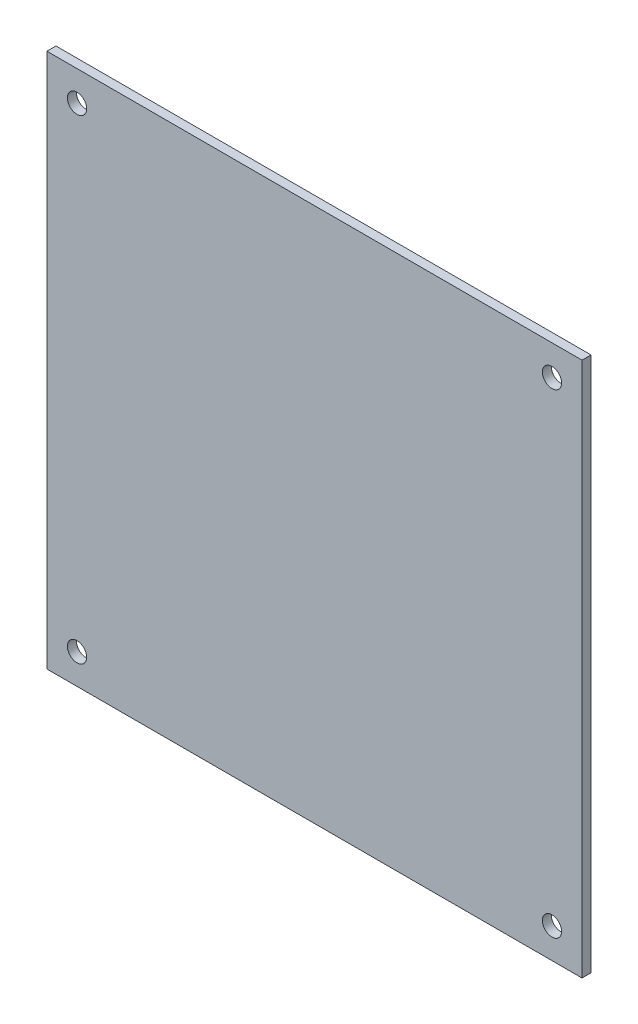
ISO-10303-21;
HEADER;
FILE_DESCRIPTION(('STEP AP214'),'2;1');
FILE_NAME('part.step','',(''),(''),'','','');
FILE_SCHEMA(('AUTOMOTIVE_DESIGN { 1 0 10303 214 1 1 1 1 }'));
ENDSEC;
DATA;
#1=APPLICATION_CONTEXT('core data for automotive mechanical design processes');
#2=APPLICATION_PROTOCOL_DEFINITION('international standard','automotive_design',2000,#1);
#3=PRODUCT_CONTEXT('',#1,'mechanical');
#4=PRODUCT('Part','Part','',(#3));
#5=PRODUCT_RELATED_PRODUCT_CATEGORY('part','',(#4));
#6=PRODUCT_DEFINITION_FORMATION('','',#4);
#7=PRODUCT_DEFINITION_CONTEXT('part definition',#1,'design');
#8=PRODUCT_DEFINITION('design','',#6,#7);
#9=PRODUCT_DEFINITION_SHAPE('','',#8);
#10=(LENGTH_UNIT() NAMED_UNIT(*) SI_UNIT(.MILLI.,.METRE.));
#11=(NAMED_UNIT(*) PLANE_ANGLE_UNIT() SI_UNIT($,.RADIAN.));
#12=(NAMED_UNIT(*) SI_UNIT($,.STERADIAN.) SOLID_ANGLE_UNIT());
#13=UNCERTAINTY_MEASURE_WITH_UNIT(LENGTH_MEASURE(1.E-05),#10,'distance_accuracy_value','');
#14=(GEOMETRIC_REPRESENTATION_CONTEXT(3) GLOBAL_UNCERTAINTY_ASSIGNED_CONTEXT((#13)) GLOBAL_UNIT_ASSIGNED_CONTEXT((#10,
#11,#12)) REPRESENTATION_CONTEXT('',''));
#15=CARTESIAN_POINT('',(0.,0.,0.));
#16=DIRECTION('',(0.,0.,1.));
#17=DIRECTION('',(1.,0.,0.));
#18=AXIS2_PLACEMENT_3D('',#15,#16,#17);
#19=CARTESIAN_POINT('',(0.,0.,1.5));
#20=DIRECTION('',(0.,0.,1.));
#21=DIRECTION('',(1.,0.,0.));
#22=AXIS2_PLACEMENT_3D('',#19,#20,#21);
#23=PLANE('',#22);
#24=CARTESIAN_POINT('',(39.5,-39.5,1.5));
#25=DIRECTION('',(0.,0.,1.));
#26=DIRECTION('',(1.,0.,0.));
#27=AXIS2_PLACEMENT_3D('',#24,#25,#26);
#28=CIRCLE('',#27,1.6);
#29=CARTESIAN_POINT('',(41.1,-39.5,1.5));
#30=VERTEX_POINT('',#29);
#31=EDGE_CURVE('E120',#30,#30,#28,.T.);
#32=ORIENTED_EDGE('',*,*,#31,.F.);
#33=EDGE_LOOP('',(#32));
#34=FACE_BOUND('',#33,.T.);
#35=CARTESIAN_POINT('',(-39.5,39.5,1.5));
#36=DIRECTION('',(0.,0.,1.));
#37=DIRECTION('',(1.,0.,0.));
#38=AXIS2_PLACEMENT_3D('',#35,#36,#37);
#39=CIRCLE('',#38,1.6);
#40=CARTESIAN_POINT('',(-37.9,39.5,1.5));
#41=VERTEX_POINT('',#40);
#42=EDGE_CURVE('E99',#41,#41,#39,.T.);
#43=ORIENTED_EDGE('',*,*,#42,.F.);
#44=EDGE_LOOP('',(#43));
#45=FACE_BOUND('',#44,.T.);
#46=DIRECTION('',(0.,-1.,0.));
#47=VECTOR('',#46,1.);
#48=CARTESIAN_POINT('',(-44.5,44.5,1.5));
#49=LINE('',#48,#47);
#50=CARTESIAN_POINT('',(-44.5,44.5,1.5));
#51=VERTEX_POINT('',#50);
#52=CARTESIAN_POINT('',(-44.5,-44.5,1.5));
#53=VERTEX_POINT('',#52);
#54=EDGE_CURVE('E84',#51,#53,#49,.T.);
#55=ORIENTED_EDGE('',*,*,#54,.T.);
#56=DIRECTION('',(1.,0.,0.));
#57=VECTOR('',#56,1.);
#58=CARTESIAN_POINT('',(-44.5,-44.5,1.5));
#59=LINE('',#58,#57);
#60=CARTESIAN_POINT('',(44.5,-44.5,1.5));
#61=VERTEX_POINT('',#60);
#62=EDGE_CURVE('E79',#53,#61,#59,.T.);
#63=ORIENTED_EDGE('',*,*,#62,.T.);
#64=DIRECTION('',(0.,1.,0.));
#65=VECTOR('',#64,1.);
#66=CARTESIAN_POINT('',(44.5,44.5,1.5));
#67=LINE('',#66,#65);
#68=CARTESIAN_POINT('',(44.5,44.5,1.5));
#69=VERTEX_POINT('',#68);
#70=EDGE_CURVE('E82',#61,#69,#67,.T.);
#71=ORIENTED_EDGE('',*,*,#70,.T.);
#72=DIRECTION('',(-1.,0.,0.));
#73=VECTOR('',#72,1.);
#74=CARTESIAN_POINT('',(-44.5,44.5,1.5));
#75=LINE('',#74,#73);
#76=EDGE_CURVE('E49',#69,#51,#75,.T.);
#77=ORIENTED_EDGE('',*,*,#76,.T.);
#78=EDGE_LOOP('',(#55,#63,#71,#77));
#79=FACE_BOUND('',#78,.T.);
#80=CARTESIAN_POINT('',(-39.5,-39.5,1.5));
#81=DIRECTION('',(0.,0.,1.));
#82=DIRECTION('',(1.,0.,0.));
#83=AXIS2_PLACEMENT_3D('',#80,#81,#82);
#84=CIRCLE('',#83,1.6);
#85=CARTESIAN_POINT('',(-37.9,-39.5,1.5));
#86=VERTEX_POINT('',#85);
#87=EDGE_CURVE('E114',#86,#86,#84,.T.);
#88=ORIENTED_EDGE('',*,*,#87,.F.);
#89=EDGE_LOOP('',(#88));
#90=FACE_BOUND('',#89,.T.);
#91=CARTESIAN_POINT('',(39.5,39.5,1.5));
#92=DIRECTION('',(0.,0.,1.));
#93=DIRECTION('',(1.,0.,0.));
#94=AXIS2_PLACEMENT_3D('',#91,#92,#93);
#95=CIRCLE('',#94,1.6);
#96=CARTESIAN_POINT('',(41.1,39.5,1.5));
#97=VERTEX_POINT('',#96);
#98=EDGE_CURVE('E126',#97,#97,#95,.T.);
#99=ORIENTED_EDGE('',*,*,#98,.F.);
#100=EDGE_LOOP('',(#99));
#101=FACE_BOUND('',#100,.T.);
#102=ADVANCED_FACE('F32',(#34,#45,#79,#90,#101),#23,.T.);
#103=CARTESIAN_POINT('',(0.,0.,0.));
#104=DIRECTION('',(0.,0.,1.));
#105=DIRECTION('',(1.,0.,0.));
#106=AXIS2_PLACEMENT_3D('',#103,#104,#105);
#107=PLANE('',#106);
#108=DIRECTION('',(0.,-1.,0.));
#109=VECTOR('',#108,1.);
#110=CARTESIAN_POINT('',(-44.5,44.5,0.));
#111=LINE('',#110,#109);
#112=CARTESIAN_POINT('',(-44.5,44.5,0.));
#113=VERTEX_POINT('',#112);
#114=CARTESIAN_POINT('',(-44.5,-44.5,0.));
#115=VERTEX_POINT('',#114);
#116=EDGE_CURVE('E96',#113,#115,#111,.T.);
#117=ORIENTED_EDGE('',*,*,#116,.F.);
#118=DIRECTION('',(-1.,0.,0.));
#119=VECTOR('',#118,1.);
#120=CARTESIAN_POINT('',(-44.5,44.5,0.));
#121=LINE('',#120,#119);
#122=CARTESIAN_POINT('',(44.5,44.5,0.));
#123=VERTEX_POINT('',#122);
#124=EDGE_CURVE('E72',#123,#113,#121,.T.);
#125=ORIENTED_EDGE('',*,*,#124,.F.);
#126=DIRECTION('',(0.,1.,0.));
#127=VECTOR('',#126,1.);
#128=CARTESIAN_POINT('',(44.5,44.5,0.));
#129=LINE('',#128,#127);
#130=CARTESIAN_POINT('',(44.5,-44.5,0.));
#131=VERTEX_POINT('',#130);
#132=EDGE_CURVE('E66',#131,#123,#129,.T.);
#133=ORIENTED_EDGE('',*,*,#132,.F.);
#134=DIRECTION('',(1.,0.,0.));
#135=VECTOR('',#134,1.);
#136=CARTESIAN_POINT('',(-44.5,-44.5,0.));
#137=LINE('',#136,#135);
#138=EDGE_CURVE('E88',#115,#131,#137,.T.);
#139=ORIENTED_EDGE('',*,*,#138,.F.);
#140=EDGE_LOOP('',(#117,#125,#133,#139));
#141=FACE_BOUND('',#140,.T.);
#142=CARTESIAN_POINT('',(-39.5,39.5,0.));
#143=DIRECTION('',(0.,0.,1.));
#144=DIRECTION('',(1.,0.,0.));
#145=AXIS2_PLACEMENT_3D('',#142,#143,#144);
#146=CIRCLE('',#145,1.6);
#147=CARTESIAN_POINT('',(-37.9,39.5,0.));
#148=VERTEX_POINT('',#147);
#149=EDGE_CURVE('E111',#148,#148,#146,.T.);
#150=ORIENTED_EDGE('',*,*,#149,.T.);
#151=EDGE_LOOP('',(#150));
#152=FACE_BOUND('',#151,.T.);
#153=CARTESIAN_POINT('',(-39.5,-39.5,0.));
#154=DIRECTION('',(0.,0.,1.));
#155=DIRECTION('',(1.,0.,0.));
#156=AXIS2_PLACEMENT_3D('',#153,#154,#155);
#157=CIRCLE('',#156,1.6);
#158=CARTESIAN_POINT('',(-37.9,-39.5,0.));
#159=VERTEX_POINT('',#158);
#160=EDGE_CURVE('E117',#159,#159,#157,.T.);
#161=ORIENTED_EDGE('',*,*,#160,.T.);
#162=EDGE_LOOP('',(#161));
#163=FACE_BOUND('',#162,.T.);
#164=CARTESIAN_POINT('',(39.5,-39.5,0.));
#165=DIRECTION('',(0.,0.,1.));
#166=DIRECTION('',(1.,0.,0.));
#167=AXIS2_PLACEMENT_3D('',#164,#165,#166);
#168=CIRCLE('',#167,1.6);
#169=CARTESIAN_POINT('',(41.1,-39.5,0.));
#170=VERTEX_POINT('',#169);
#171=EDGE_CURVE('E123',#170,#170,#168,.T.);
#172=ORIENTED_EDGE('',*,*,#171,.T.);
#173=EDGE_LOOP('',(#172));
#174=FACE_BOUND('',#173,.T.);
#175=CARTESIAN_POINT('',(39.5,39.5,0.));
#176=DIRECTION('',(0.,0.,1.));
#177=DIRECTION('',(1.,0.,0.));
#178=AXIS2_PLACEMENT_3D('',#175,#176,#177);
#179=CIRCLE('',#178,1.6);
#180=CARTESIAN_POINT('',(41.1,39.5,0.));
#181=VERTEX_POINT('',#180);
#182=EDGE_CURVE('E129',#181,#181,#179,.T.);
#183=ORIENTED_EDGE('',*,*,#182,.T.);
#184=EDGE_LOOP('',(#183));
#185=FACE_BOUND('',#184,.T.);
#186=ADVANCED_FACE('F107',(#141,#152,#163,#174,#185),#107,.F.);
#187=CARTESIAN_POINT('',(-44.5,44.5,1.5));
#188=DIRECTION('',(1.,0.,0.));
#189=DIRECTION('',(0.,1.,0.));
#190=AXIS2_PLACEMENT_3D('',#187,#188,#189);
#191=PLANE('',#190);
#192=ORIENTED_EDGE('',*,*,#116,.T.);
#193=DIRECTION('',(0.,0.,-1.));
#194=VECTOR('',#193,1.);
#195=CARTESIAN_POINT('',(-44.5,-44.5,1.5));
#196=LINE('',#195,#194);
#197=EDGE_CURVE('E11',#53,#115,#196,.T.);
#198=ORIENTED_EDGE('',*,*,#197,.F.);
#199=ORIENTED_EDGE('',*,*,#54,.F.);
#200=DIRECTION('',(0.,0.,-1.));
#201=VECTOR('',#200,1.);
#202=CARTESIAN_POINT('',(-44.5,44.5,1.5));
#203=LINE('',#202,#201);
#204=EDGE_CURVE('E92',#51,#113,#203,.T.);
#205=ORIENTED_EDGE('',*,*,#204,.T.);
#206=EDGE_LOOP('',(#192,#198,#199,#205));
#207=FACE_BOUND('',#206,.T.);
#208=ADVANCED_FACE('F34',(#207),#191,.F.);
#209=CARTESIAN_POINT('',(-44.5,-44.5,1.5));
#210=DIRECTION('',(0.,1.,0.));
#211=DIRECTION('',(0.,0.,1.));
#212=AXIS2_PLACEMENT_3D('',#209,#210,#211);
#213=PLANE('',#212);
#214=ORIENTED_EDGE('',*,*,#138,.T.);
#215=DIRECTION('',(0.,0.,-1.));
#216=VECTOR('',#215,1.);
#217=CARTESIAN_POINT('',(44.5,-44.5,1.5));
#218=LINE('',#217,#216);
#219=EDGE_CURVE('E41',#61,#131,#218,.T.);
#220=ORIENTED_EDGE('',*,*,#219,.F.);
#221=ORIENTED_EDGE('',*,*,#62,.F.);
#222=ORIENTED_EDGE('',*,*,#197,.T.);
#223=EDGE_LOOP('',(#214,#220,#221,#222));
#224=FACE_BOUND('',#223,.T.);
#225=ADVANCED_FACE('F87',(#224),#213,.F.);
#226=CARTESIAN_POINT('',(44.5,44.5,1.5));
#227=DIRECTION('',(-1.,0.,0.));
#228=DIRECTION('',(0.,-1.,0.));
#229=AXIS2_PLACEMENT_3D('',#226,#227,#228);
#230=PLANE('',#229);
#231=ORIENTED_EDGE('',*,*,#132,.T.);
#232=DIRECTION('',(0.,0.,-1.));
#233=VECTOR('',#232,1.);
#234=CARTESIAN_POINT('',(44.5,44.5,1.5));
#235=LINE('',#234,#233);
#236=EDGE_CURVE('E89',#69,#123,#235,.T.);
#237=ORIENTED_EDGE('',*,*,#236,.F.);
#238=ORIENTED_EDGE('',*,*,#70,.F.);
#239=ORIENTED_EDGE('',*,*,#219,.T.);
#240=EDGE_LOOP('',(#231,#237,#238,#239));
#241=FACE_BOUND('',#240,.T.);
#242=ADVANCED_FACE('F90',(#241),#230,.F.);
#243=CARTESIAN_POINT('',(-44.5,44.5,1.5));
#244=DIRECTION('',(0.,-1.,0.));
#245=DIRECTION('',(0.,0.,-1.));
#246=AXIS2_PLACEMENT_3D('',#243,#244,#245);
#247=PLANE('',#246);
#248=ORIENTED_EDGE('',*,*,#124,.T.);
#249=ORIENTED_EDGE('',*,*,#204,.F.);
#250=ORIENTED_EDGE('',*,*,#76,.F.);
#251=ORIENTED_EDGE('',*,*,#236,.T.);
#252=EDGE_LOOP('',(#248,#249,#250,#251));
#253=FACE_BOUND('',#252,.T.);
#254=ADVANCED_FACE('F104',(#253),#247,.F.);
#255=CARTESIAN_POINT('',(-39.5,39.5,1.5));
#256=DIRECTION('',(0.,0.,-1.));
#257=DIRECTION('',(-1.,0.,0.));
#258=AXIS2_PLACEMENT_3D('',#255,#256,#257);
#259=CYLINDRICAL_SURFACE('',#258,1.6);
#260=ORIENTED_EDGE('',*,*,#42,.T.);
#261=EDGE_LOOP('',(#260));
#262=FACE_BOUND('',#261,.T.);
#263=ORIENTED_EDGE('',*,*,#149,.F.);
#264=EDGE_LOOP('',(#263));
#265=FACE_BOUND('',#264,.T.);
#266=ADVANCED_FACE('F148',(#262,#265),#259,.F.);
#267=CARTESIAN_POINT('',(-39.5,-39.5,1.5));
#268=DIRECTION('',(0.,0.,-1.));
#269=DIRECTION('',(-1.,0.,0.));
#270=AXIS2_PLACEMENT_3D('',#267,#268,#269);
#271=CYLINDRICAL_SURFACE('',#270,1.6);
#272=ORIENTED_EDGE('',*,*,#87,.T.);
#273=EDGE_LOOP('',(#272));
#274=FACE_BOUND('',#273,.T.);
#275=ORIENTED_EDGE('',*,*,#160,.F.);
#276=EDGE_LOOP('',(#275));
#277=FACE_BOUND('',#276,.T.);
#278=ADVANCED_FACE('F194',(#274,#277),#271,.F.);
#279=CARTESIAN_POINT('',(39.5,-39.5,1.5));
#280=DIRECTION('',(0.,0.,-1.));
#281=DIRECTION('',(-1.,0.,0.));
#282=AXIS2_PLACEMENT_3D('',#279,#280,#281);
#283=CYLINDRICAL_SURFACE('',#282,1.6);
#284=ORIENTED_EDGE('',*,*,#31,.T.);
#285=EDGE_LOOP('',(#284));
#286=FACE_BOUND('',#285,.T.);
#287=ORIENTED_EDGE('',*,*,#171,.F.);
#288=EDGE_LOOP('',(#287));
#289=FACE_BOUND('',#288,.T.);
#290=ADVANCED_FACE('F202',(#286,#289),#283,.F.);
#291=CARTESIAN_POINT('',(39.5,39.5,1.5));
#292=DIRECTION('',(0.,0.,-1.));
#293=DIRECTION('',(-1.,0.,0.));
#294=AXIS2_PLACEMENT_3D('',#291,#292,#293);
#295=CYLINDRICAL_SURFACE('',#294,1.6);
#296=ORIENTED_EDGE('',*,*,#98,.T.);
#297=EDGE_LOOP('',(#296));
#298=FACE_BOUND('',#297,.T.);
#299=ORIENTED_EDGE('',*,*,#182,.F.);
#300=EDGE_LOOP('',(#299));
#301=FACE_BOUND('',#300,.T.);
#302=ADVANCED_FACE('F135',(#298,#301),#295,.F.);
#303=CLOSED_SHELL('',(#102,#186,#208,#225,#242,#254,#266,#278,#290,#302));
#304=MANIFOLD_SOLID_BREP('B2',#303);
#305=ADVANCED_BREP_SHAPE_REPRESENTATION('',(#18,#304),#14);
#306=SHAPE_DEFINITION_REPRESENTATION(#9,#305);
ENDSEC;
END-ISO-10303-21;
